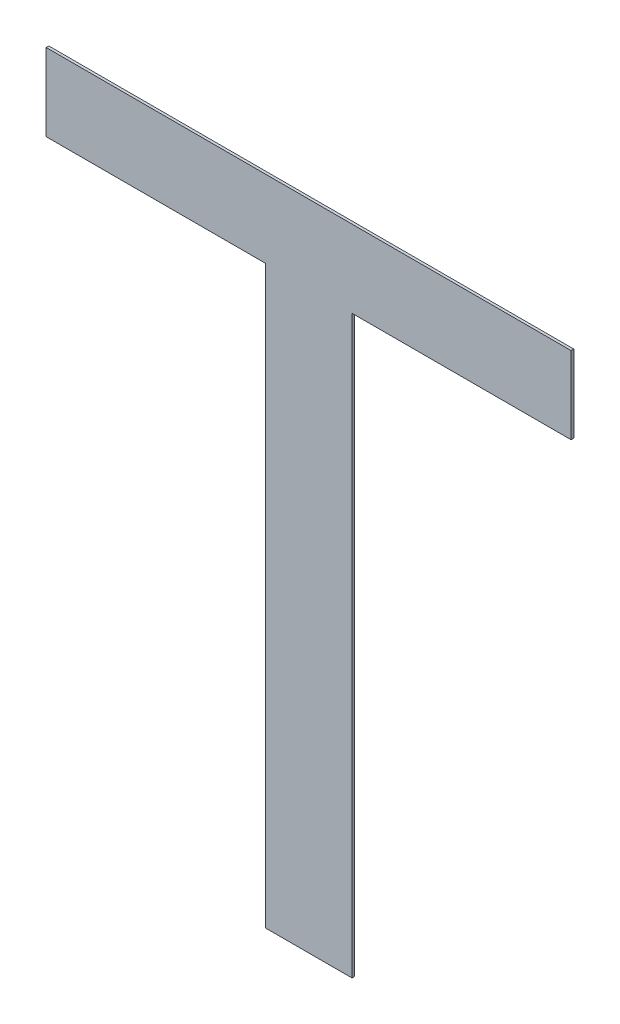
ISO-10303-21;
HEADER;
FILE_DESCRIPTION(('STEP AP214'),'2;1');
FILE_NAME('part.step','',(''),(''),'','','');
FILE_SCHEMA(('AUTOMOTIVE_DESIGN { 1 0 10303 214 1 1 1 1 }'));
ENDSEC;
DATA;
#1=APPLICATION_CONTEXT('core data for automotive mechanical design processes');
#2=APPLICATION_PROTOCOL_DEFINITION('international standard','automotive_design',2000,#1);
#3=PRODUCT_CONTEXT('',#1,'mechanical');
#4=PRODUCT('Part','Part','',(#3));
#5=PRODUCT_RELATED_PRODUCT_CATEGORY('part','',(#4));
#6=PRODUCT_DEFINITION_FORMATION('','',#4);
#7=PRODUCT_DEFINITION_CONTEXT('part definition',#1,'design');
#8=PRODUCT_DEFINITION('design','',#6,#7);
#9=PRODUCT_DEFINITION_SHAPE('','',#8);
#10=(LENGTH_UNIT() NAMED_UNIT(*) SI_UNIT(.MILLI.,.METRE.));
#11=(NAMED_UNIT(*) PLANE_ANGLE_UNIT() SI_UNIT($,.RADIAN.));
#12=(NAMED_UNIT(*) SI_UNIT($,.STERADIAN.) SOLID_ANGLE_UNIT());
#13=UNCERTAINTY_MEASURE_WITH_UNIT(LENGTH_MEASURE(1.E-05),#10,'distance_accuracy_value','');
#14=(GEOMETRIC_REPRESENTATION_CONTEXT(3) GLOBAL_UNCERTAINTY_ASSIGNED_CONTEXT((#13)) GLOBAL_UNIT_ASSIGNED_CONTEXT((#10,
#11,#12)) REPRESENTATION_CONTEXT('',''));
#15=CARTESIAN_POINT('',(0.,0.,0.));
#16=DIRECTION('',(0.,0.,1.));
#17=DIRECTION('',(1.,0.,0.));
#18=AXIS2_PLACEMENT_3D('',#15,#16,#17);
#19=CARTESIAN_POINT('',(-1.06893357571974,-0.89500541970053,0.));
#20=DIRECTION('',(0.,-1.,0.));
#21=DIRECTION('',(1.,0.,0.));
#22=AXIS2_PLACEMENT_3D('',#19,#20,#21);
#23=PLANE('',#22);
#24=DIRECTION('',(-1.,0.,0.));
#25=VECTOR('',#24,1.);
#26=CARTESIAN_POINT('',(-0.904541359597708,-0.89500541970053,0.));
#27=LINE('',#26,#25);
#28=CARTESIAN_POINT('',(-0.904541359597708,-0.89500541970053,0.));
#29=VERTEX_POINT('',#28);
#30=CARTESIAN_POINT('',(-1.06893357571974,-0.89500541970053,0.));
#31=VERTEX_POINT('',#30);
#32=EDGE_CURVE('E11',#29,#31,#27,.T.);
#33=ORIENTED_EDGE('',*,*,#32,.F.);
#34=DIRECTION('',(0.,0.,1.));
#35=VECTOR('',#34,1.);
#36=CARTESIAN_POINT('',(-0.904541359597708,-0.89500541970053,0.));
#37=LINE('',#36,#35);
#38=CARTESIAN_POINT('',(-0.904541359597708,-0.89500541970053,0.002));
#39=VERTEX_POINT('',#38);
#40=EDGE_CURVE('E145',#29,#39,#37,.T.);
#41=ORIENTED_EDGE('',*,*,#40,.T.);
#42=DIRECTION('',(1.,0.,0.));
#43=VECTOR('',#42,1.);
#44=CARTESIAN_POINT('',(-1.06893357571974,-0.89500541970053,0.002));
#45=LINE('',#44,#43);
#46=CARTESIAN_POINT('',(-1.06893357571974,-0.89500541970053,0.002));
#47=VERTEX_POINT('',#46);
#48=EDGE_CURVE('E103',#47,#39,#45,.T.);
#49=ORIENTED_EDGE('',*,*,#48,.F.);
#50=DIRECTION('',(0.,0.,1.));
#51=VECTOR('',#50,1.);
#52=CARTESIAN_POINT('',(-1.06893357571974,-0.89500541970053,0.));
#53=LINE('',#52,#51);
#54=EDGE_CURVE('E140',#31,#47,#53,.T.);
#55=ORIENTED_EDGE('',*,*,#54,.F.);
#56=EDGE_LOOP('',(#33,#41,#49,#55));
#57=FACE_BOUND('',#56,.T.);
#58=ADVANCED_FACE('F17',(#57),#23,.T.);
#59=CARTESIAN_POINT('',(-1.06893357571974,-0.837031353145417,0.));
#60=DIRECTION('',(-1.,0.,0.));
#61=DIRECTION('',(0.,-1.,0.));
#62=AXIS2_PLACEMENT_3D('',#59,#60,#61);
#63=PLANE('',#62);
#64=DIRECTION('',(0.,1.,0.));
#65=VECTOR('',#64,1.);
#66=CARTESIAN_POINT('',(-1.06893357571974,-0.89500541970053,0.));
#67=LINE('',#66,#65);
#68=CARTESIAN_POINT('',(-1.06893357571974,-0.837031353145417,0.));
#69=VERTEX_POINT('',#68);
#70=EDGE_CURVE('E24',#31,#69,#67,.T.);
#71=ORIENTED_EDGE('',*,*,#70,.F.);
#72=ORIENTED_EDGE('',*,*,#54,.T.);
#73=DIRECTION('',(0.,-1.,0.));
#74=VECTOR('',#73,1.);
#75=CARTESIAN_POINT('',(-1.06893357571974,-0.837031353145417,0.002));
#76=LINE('',#75,#74);
#77=CARTESIAN_POINT('',(-1.06893357571974,-0.837031353145417,0.002));
#78=VERTEX_POINT('',#77);
#79=EDGE_CURVE('E132',#78,#47,#76,.T.);
#80=ORIENTED_EDGE('',*,*,#79,.F.);
#81=DIRECTION('',(0.,0.,1.));
#82=VECTOR('',#81,1.);
#83=CARTESIAN_POINT('',(-1.06893357571974,-0.837031353145417,0.));
#84=LINE('',#83,#82);
#85=EDGE_CURVE('E134',#69,#78,#84,.T.);
#86=ORIENTED_EDGE('',*,*,#85,.F.);
#87=EDGE_LOOP('',(#71,#72,#80,#86));
#88=FACE_BOUND('',#87,.T.);
#89=ADVANCED_FACE('F150',(#88),#63,.T.);
#90=CARTESIAN_POINT('',(-0.67502758926308,-0.837031353145417,0.));
#91=DIRECTION('',(0.,1.,0.));
#92=DIRECTION('',(-1.,0.,0.));
#93=AXIS2_PLACEMENT_3D('',#90,#91,#92);
#94=PLANE('',#93);
#95=DIRECTION('',(1.,0.,0.));
#96=VECTOR('',#95,1.);
#97=CARTESIAN_POINT('',(-1.06893357571974,-0.837031353145417,0.));
#98=LINE('',#97,#96);
#99=CARTESIAN_POINT('',(-0.67502758926308,-0.837031353145417,0.));
#100=VERTEX_POINT('',#99);
#101=EDGE_CURVE('E142',#69,#100,#98,.T.);
#102=ORIENTED_EDGE('',*,*,#101,.F.);
#103=ORIENTED_EDGE('',*,*,#85,.T.);
#104=DIRECTION('',(-1.,0.,0.));
#105=VECTOR('',#104,1.);
#106=CARTESIAN_POINT('',(-0.67502758926308,-0.837031353145417,0.002));
#107=LINE('',#106,#105);
#108=CARTESIAN_POINT('',(-0.67502758926308,-0.837031353145417,0.002));
#109=VERTEX_POINT('',#108);
#110=EDGE_CURVE('E124',#109,#78,#107,.T.);
#111=ORIENTED_EDGE('',*,*,#110,.F.);
#112=DIRECTION('',(0.,0.,1.));
#113=VECTOR('',#112,1.);
#114=CARTESIAN_POINT('',(-0.67502758926308,-0.837031353145417,0.));
#115=LINE('',#114,#113);
#116=EDGE_CURVE('E127',#100,#109,#115,.T.);
#117=ORIENTED_EDGE('',*,*,#116,.F.);
#118=EDGE_LOOP('',(#102,#103,#111,#117));
#119=FACE_BOUND('',#118,.T.);
#120=ADVANCED_FACE('F152',(#119),#94,.T.);
#121=CARTESIAN_POINT('',(-0.67502758926308,-0.89500541970053,0.));
#122=DIRECTION('',(1.,0.,0.));
#123=DIRECTION('',(0.,1.,0.));
#124=AXIS2_PLACEMENT_3D('',#121,#122,#123);
#125=PLANE('',#124);
#126=DIRECTION('',(0.,-1.,0.));
#127=VECTOR('',#126,1.);
#128=CARTESIAN_POINT('',(-0.67502758926308,-0.837031353145417,0.));
#129=LINE('',#128,#127);
#130=CARTESIAN_POINT('',(-0.67502758926308,-0.89500541970053,0.));
#131=VERTEX_POINT('',#130);
#132=EDGE_CURVE('E136',#100,#131,#129,.T.);
#133=ORIENTED_EDGE('',*,*,#132,.F.);
#134=ORIENTED_EDGE('',*,*,#116,.T.);
#135=DIRECTION('',(0.,1.,0.));
#136=VECTOR('',#135,1.);
#137=CARTESIAN_POINT('',(-0.67502758926308,-0.89500541970053,0.002));
#138=LINE('',#137,#136);
#139=CARTESIAN_POINT('',(-0.67502758926308,-0.89500541970053,0.002));
#140=VERTEX_POINT('',#139);
#141=EDGE_CURVE('E116',#140,#109,#138,.T.);
#142=ORIENTED_EDGE('',*,*,#141,.F.);
#143=DIRECTION('',(0.,0.,1.));
#144=VECTOR('',#143,1.);
#145=CARTESIAN_POINT('',(-0.67502758926308,-0.89500541970053,0.));
#146=LINE('',#145,#144);
#147=EDGE_CURVE('E119',#131,#140,#146,.T.);
#148=ORIENTED_EDGE('',*,*,#147,.F.);
#149=EDGE_LOOP('',(#133,#134,#142,#148));
#150=FACE_BOUND('',#149,.T.);
#151=ADVANCED_FACE('F156',(#150),#125,.T.);
#152=CARTESIAN_POINT('',(-0.839419805385115,-0.89500541970053,0.));
#153=DIRECTION('',(0.,-1.,0.));
#154=DIRECTION('',(1.,0.,0.));
#155=AXIS2_PLACEMENT_3D('',#152,#153,#154);
#156=PLANE('',#155);
#157=DIRECTION('',(-1.,0.,0.));
#158=VECTOR('',#157,1.);
#159=CARTESIAN_POINT('',(-0.67502758926308,-0.89500541970053,0.));
#160=LINE('',#159,#158);
#161=CARTESIAN_POINT('',(-0.839419805385115,-0.89500541970053,0.));
#162=VERTEX_POINT('',#161);
#163=EDGE_CURVE('E129',#131,#162,#160,.T.);
#164=ORIENTED_EDGE('',*,*,#163,.F.);
#165=ORIENTED_EDGE('',*,*,#147,.T.);
#166=DIRECTION('',(1.,0.,0.));
#167=VECTOR('',#166,1.);
#168=CARTESIAN_POINT('',(-0.839419805385115,-0.89500541970053,0.002));
#169=LINE('',#168,#167);
#170=CARTESIAN_POINT('',(-0.839419805385115,-0.89500541970053,0.002));
#171=VERTEX_POINT('',#170);
#172=EDGE_CURVE('E109',#171,#140,#169,.T.);
#173=ORIENTED_EDGE('',*,*,#172,.F.);
#174=DIRECTION('',(0.,0.,1.));
#175=VECTOR('',#174,1.);
#176=CARTESIAN_POINT('',(-0.839419805385115,-0.89500541970053,0.));
#177=LINE('',#176,#175);
#178=EDGE_CURVE('E112',#162,#171,#177,.T.);
#179=ORIENTED_EDGE('',*,*,#178,.F.);
#180=EDGE_LOOP('',(#164,#165,#173,#179));
#181=FACE_BOUND('',#180,.T.);
#182=ADVANCED_FACE('F160',(#181),#156,.T.);
#183=CARTESIAN_POINT('',(-0.839419805385115,-1.32703134033042,0.));
#184=DIRECTION('',(1.,0.,0.));
#185=DIRECTION('',(0.,1.,0.));
#186=AXIS2_PLACEMENT_3D('',#183,#184,#185);
#187=PLANE('',#186);
#188=DIRECTION('',(0.,-1.,0.));
#189=VECTOR('',#188,1.);
#190=CARTESIAN_POINT('',(-0.839419805385115,-0.89500541970053,0.));
#191=LINE('',#190,#189);
#192=CARTESIAN_POINT('',(-0.839419805385115,-1.32703134033042,0.));
#193=VERTEX_POINT('',#192);
#194=EDGE_CURVE('E121',#162,#193,#191,.T.);
#195=ORIENTED_EDGE('',*,*,#194,.F.);
#196=ORIENTED_EDGE('',*,*,#178,.T.);
#197=DIRECTION('',(0.,1.,0.));
#198=VECTOR('',#197,1.);
#199=CARTESIAN_POINT('',(-0.839419805385115,-1.32703134033042,0.002));
#200=LINE('',#199,#198);
#201=CARTESIAN_POINT('',(-0.839419805385115,-1.32703134033042,0.002));
#202=VERTEX_POINT('',#201);
#203=EDGE_CURVE('E89',#202,#171,#200,.T.);
#204=ORIENTED_EDGE('',*,*,#203,.F.);
#205=DIRECTION('',(0.,0.,1.));
#206=VECTOR('',#205,1.);
#207=CARTESIAN_POINT('',(-0.839419805385115,-1.32703134033042,0.));
#208=LINE('',#207,#206);
#209=EDGE_CURVE('E95',#193,#202,#208,.T.);
#210=ORIENTED_EDGE('',*,*,#209,.F.);
#211=EDGE_LOOP('',(#195,#196,#204,#210));
#212=FACE_BOUND('',#211,.T.);
#213=ADVANCED_FACE('F163',(#212),#187,.T.);
#214=CARTESIAN_POINT('',(-0.904541359597708,-1.32703134033042,0.));
#215=DIRECTION('',(0.,-1.,0.));
#216=DIRECTION('',(1.,0.,0.));
#217=AXIS2_PLACEMENT_3D('',#214,#215,#216);
#218=PLANE('',#217);
#219=DIRECTION('',(-1.,0.,0.));
#220=VECTOR('',#219,1.);
#221=CARTESIAN_POINT('',(-0.839419805385115,-1.32703134033042,0.));
#222=LINE('',#221,#220);
#223=CARTESIAN_POINT('',(-0.904541359597708,-1.32703134033042,0.));
#224=VERTEX_POINT('',#223);
#225=EDGE_CURVE('E114',#193,#224,#222,.T.);
#226=ORIENTED_EDGE('',*,*,#225,.F.);
#227=ORIENTED_EDGE('',*,*,#209,.T.);
#228=DIRECTION('',(1.,0.,0.));
#229=VECTOR('',#228,1.);
#230=CARTESIAN_POINT('',(-0.904541359597708,-1.32703134033042,0.002));
#231=LINE('',#230,#229);
#232=CARTESIAN_POINT('',(-0.904541359597708,-1.32703134033042,0.002));
#233=VERTEX_POINT('',#232);
#234=EDGE_CURVE('E90',#233,#202,#231,.T.);
#235=ORIENTED_EDGE('',*,*,#234,.F.);
#236=DIRECTION('',(0.,0.,1.));
#237=VECTOR('',#236,1.);
#238=CARTESIAN_POINT('',(-0.904541359597708,-1.32703134033042,0.));
#239=LINE('',#238,#237);
#240=EDGE_CURVE('E79',#224,#233,#239,.T.);
#241=ORIENTED_EDGE('',*,*,#240,.F.);
#242=EDGE_LOOP('',(#226,#227,#235,#241));
#243=FACE_BOUND('',#242,.T.);
#244=ADVANCED_FACE('F93',(#243),#218,.T.);
#245=CARTESIAN_POINT('',(-0.904541359597708,-0.89500541970053,0.));
#246=DIRECTION('',(-1.,0.,0.));
#247=DIRECTION('',(0.,-1.,0.));
#248=AXIS2_PLACEMENT_3D('',#245,#246,#247);
#249=PLANE('',#248);
#250=DIRECTION('',(0.,1.,0.));
#251=VECTOR('',#250,1.);
#252=CARTESIAN_POINT('',(-0.904541359597708,-1.32703134033042,0.));
#253=LINE('',#252,#251);
#254=EDGE_CURVE('E86',#224,#29,#253,.T.);
#255=ORIENTED_EDGE('',*,*,#254,.F.);
#256=ORIENTED_EDGE('',*,*,#240,.T.);
#257=DIRECTION('',(0.,-1.,0.));
#258=VECTOR('',#257,1.);
#259=CARTESIAN_POINT('',(-0.904541359597708,-0.89500541970053,0.002));
#260=LINE('',#259,#258);
#261=EDGE_CURVE('E84',#39,#233,#260,.T.);
#262=ORIENTED_EDGE('',*,*,#261,.F.);
#263=ORIENTED_EDGE('',*,*,#40,.F.);
#264=EDGE_LOOP('',(#255,#256,#262,#263));
#265=FACE_BOUND('',#264,.T.);
#266=ADVANCED_FACE('F81',(#265),#249,.T.);
#267=CARTESIAN_POINT('',(-0.871980582491411,-1.00168151244287,0.));
#268=DIRECTION('',(0.,0.,1.));
#269=DIRECTION('',(1.,0.,0.));
#270=AXIS2_PLACEMENT_3D('',#267,#268,#269);
#271=PLANE('',#270);
#272=ORIENTED_EDGE('',*,*,#254,.T.);
#273=ORIENTED_EDGE('',*,*,#32,.T.);
#274=ORIENTED_EDGE('',*,*,#70,.T.);
#275=ORIENTED_EDGE('',*,*,#101,.T.);
#276=ORIENTED_EDGE('',*,*,#132,.T.);
#277=ORIENTED_EDGE('',*,*,#163,.T.);
#278=ORIENTED_EDGE('',*,*,#194,.T.);
#279=ORIENTED_EDGE('',*,*,#225,.T.);
#280=EDGE_LOOP('',(#272,#273,#274,#275,#276,#277,#278,#279));
#281=FACE_BOUND('',#280,.T.);
#282=ADVANCED_FACE('F147',(#281),#271,.F.);
#283=CARTESIAN_POINT('',(-0.871980582491411,-1.00168151244287,0.002));
#284=DIRECTION('',(0.,0.,1.));
#285=DIRECTION('',(1.,0.,0.));
#286=AXIS2_PLACEMENT_3D('',#283,#284,#285);
#287=PLANE('',#286);
#288=ORIENTED_EDGE('',*,*,#261,.T.);
#289=ORIENTED_EDGE('',*,*,#234,.T.);
#290=ORIENTED_EDGE('',*,*,#203,.T.);
#291=ORIENTED_EDGE('',*,*,#172,.T.);
#292=ORIENTED_EDGE('',*,*,#141,.T.);
#293=ORIENTED_EDGE('',*,*,#110,.T.);
#294=ORIENTED_EDGE('',*,*,#79,.T.);
#295=ORIENTED_EDGE('',*,*,#48,.T.);
#296=EDGE_LOOP('',(#288,#289,#290,#291,#292,#293,#294,#295));
#297=FACE_BOUND('',#296,.T.);
#298=ADVANCED_FACE('F100',(#297),#287,.T.);
#299=CLOSED_SHELL('',(#58,#89,#120,#151,#182,#213,#244,#266,#282,#298));
#300=MANIFOLD_SOLID_BREP('B1',#299);
#301=ADVANCED_BREP_SHAPE_REPRESENTATION('',(#18,#300),#14);
#302=SHAPE_DEFINITION_REPRESENTATION(#9,#301);
ENDSEC;
END-ISO-10303-21;
